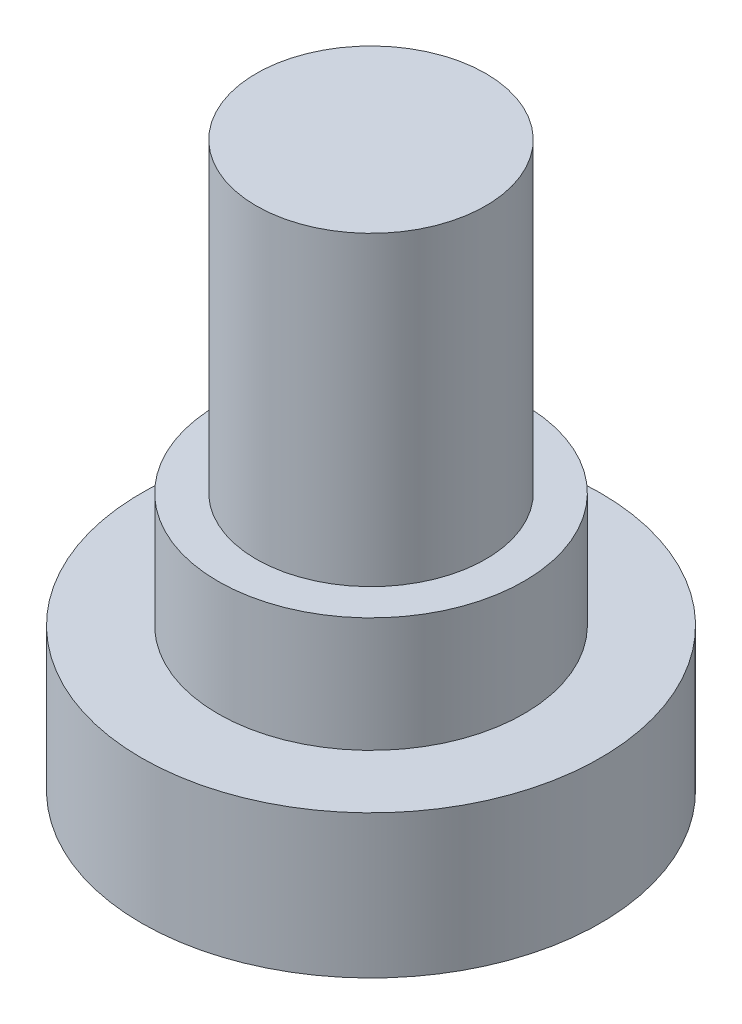
ISO-10303-21;
HEADER;
FILE_DESCRIPTION(('STEP AP214'),'2;1');
FILE_NAME('part.step','',(''),(''),'','','');
FILE_SCHEMA(('AUTOMOTIVE_DESIGN { 1 0 10303 214 1 1 1 1 }'));
ENDSEC;
DATA;
#1=APPLICATION_CONTEXT('core data for automotive mechanical design processes');
#2=APPLICATION_PROTOCOL_DEFINITION('international standard','automotive_design',2000,#1);
#3=PRODUCT_CONTEXT('',#1,'mechanical');
#4=PRODUCT('Part','Part','',(#3));
#5=PRODUCT_RELATED_PRODUCT_CATEGORY('part','',(#4));
#6=PRODUCT_DEFINITION_FORMATION('','',#4);
#7=PRODUCT_DEFINITION_CONTEXT('part definition',#1,'design');
#8=PRODUCT_DEFINITION('design','',#6,#7);
#9=PRODUCT_DEFINITION_SHAPE('','',#8);
#10=(LENGTH_UNIT() NAMED_UNIT(*) SI_UNIT(.MILLI.,.METRE.));
#11=(NAMED_UNIT(*) PLANE_ANGLE_UNIT() SI_UNIT($,.RADIAN.));
#12=(NAMED_UNIT(*) SI_UNIT($,.STERADIAN.) SOLID_ANGLE_UNIT());
#13=UNCERTAINTY_MEASURE_WITH_UNIT(LENGTH_MEASURE(1.E-05),#10,'distance_accuracy_value','');
#14=(GEOMETRIC_REPRESENTATION_CONTEXT(3) GLOBAL_UNCERTAINTY_ASSIGNED_CONTEXT((#13)) GLOBAL_UNIT_ASSIGNED_CONTEXT((#10,
#11,#12)) REPRESENTATION_CONTEXT('',''));
#15=CARTESIAN_POINT('',(0.,0.,0.));
#16=DIRECTION('',(0.,0.,1.));
#17=DIRECTION('',(1.,0.,0.));
#18=AXIS2_PLACEMENT_3D('',#15,#16,#17);
#19=CARTESIAN_POINT('',(0.,3.74,0.));
#20=DIRECTION('',(0.,-1.,0.));
#21=DIRECTION('',(0.,0.,-1.));
#22=AXIS2_PLACEMENT_3D('',#19,#20,#21);
#23=CYLINDRICAL_SURFACE('',#22,6.);
#24=CARTESIAN_POINT('',(0.,3.74,0.));
#25=DIRECTION('',(0.,1.,0.));
#26=DIRECTION('',(0.,0.,1.));
#27=AXIS2_PLACEMENT_3D('',#24,#25,#26);
#28=CIRCLE('',#27,6.);
#29=CARTESIAN_POINT('',(0.,3.74,6.));
#30=VERTEX_POINT('',#29);
#31=EDGE_CURVE('E51',#30,#30,#28,.T.);
#32=ORIENTED_EDGE('',*,*,#31,.F.);
#33=EDGE_LOOP('',(#32));
#34=FACE_BOUND('',#33,.T.);
#35=CARTESIAN_POINT('',(0.,0.,0.));
#36=DIRECTION('',(0.,1.,0.));
#37=DIRECTION('',(0.,0.,1.));
#38=AXIS2_PLACEMENT_3D('',#35,#36,#37);
#39=CIRCLE('',#38,6.);
#40=CARTESIAN_POINT('',(0.,0.,6.));
#41=VERTEX_POINT('',#40);
#42=EDGE_CURVE('E40',#41,#41,#39,.T.);
#43=ORIENTED_EDGE('',*,*,#42,.T.);
#44=EDGE_LOOP('',(#43));
#45=FACE_BOUND('',#44,.T.);
#46=ADVANCED_FACE('F37',(#34,#45),#23,.T.);
#47=CARTESIAN_POINT('',(0.,3.74,0.));
#48=DIRECTION('',(0.,1.,0.));
#49=DIRECTION('',(0.,0.,1.));
#50=AXIS2_PLACEMENT_3D('',#47,#48,#49);
#51=PLANE('',#50);
#52=CARTESIAN_POINT('',(0.,3.74,0.));
#53=DIRECTION('',(0.,1.,0.));
#54=DIRECTION('',(0.,0.,1.));
#55=AXIS2_PLACEMENT_3D('',#52,#53,#54);
#56=CIRCLE('',#55,4.);
#57=CARTESIAN_POINT('',(0.,3.74,4.));
#58=VERTEX_POINT('',#57);
#59=EDGE_CURVE('E45',#58,#58,#56,.T.);
#60=ORIENTED_EDGE('',*,*,#59,.F.);
#61=EDGE_LOOP('',(#60));
#62=FACE_BOUND('',#61,.T.);
#63=ORIENTED_EDGE('',*,*,#31,.T.);
#64=EDGE_LOOP('',(#63));
#65=FACE_BOUND('',#64,.T.);
#66=ADVANCED_FACE('F71',(#62,#65),#51,.T.);
#67=CARTESIAN_POINT('',(0.,0.,0.));
#68=DIRECTION('',(0.,1.,0.));
#69=DIRECTION('',(0.,0.,1.));
#70=AXIS2_PLACEMENT_3D('',#67,#68,#69);
#71=PLANE('',#70);
#72=ORIENTED_EDGE('',*,*,#42,.F.);
#73=EDGE_LOOP('',(#72));
#74=FACE_BOUND('',#73,.T.);
#75=ADVANCED_FACE('F68',(#74),#71,.F.);
#76=CARTESIAN_POINT('',(0.,6.74,0.));
#77=DIRECTION('',(0.,-1.,0.));
#78=DIRECTION('',(0.,0.,-1.));
#79=AXIS2_PLACEMENT_3D('',#76,#77,#78);
#80=CYLINDRICAL_SURFACE('',#79,4.);
#81=CARTESIAN_POINT('',(0.,6.74,0.));
#82=DIRECTION('',(0.,1.,0.));
#83=DIRECTION('',(0.,0.,1.));
#84=AXIS2_PLACEMENT_3D('',#81,#82,#83);
#85=CIRCLE('',#84,4.);
#86=CARTESIAN_POINT('',(0.,6.74,4.));
#87=VERTEX_POINT('',#86);
#88=EDGE_CURVE('E56',#87,#87,#85,.T.);
#89=ORIENTED_EDGE('',*,*,#88,.F.);
#90=EDGE_LOOP('',(#89));
#91=FACE_BOUND('',#90,.T.);
#92=ORIENTED_EDGE('',*,*,#59,.T.);
#93=EDGE_LOOP('',(#92));
#94=FACE_BOUND('',#93,.T.);
#95=ADVANCED_FACE('F70',(#91,#94),#80,.T.);
#96=CARTESIAN_POINT('',(0.,6.74,0.));
#97=DIRECTION('',(0.,1.,0.));
#98=DIRECTION('',(0.,0.,1.));
#99=AXIS2_PLACEMENT_3D('',#96,#97,#98);
#100=PLANE('',#99);
#101=CARTESIAN_POINT('',(0.,6.74,0.));
#102=DIRECTION('',(0.,1.,0.));
#103=DIRECTION('',(0.,0.,1.));
#104=AXIS2_PLACEMENT_3D('',#101,#102,#103);
#105=CIRCLE('',#104,3.);
#106=CARTESIAN_POINT('',(0.,6.74,3.));
#107=VERTEX_POINT('',#106);
#108=EDGE_CURVE('E10',#107,#107,#105,.T.);
#109=ORIENTED_EDGE('',*,*,#108,.F.);
#110=EDGE_LOOP('',(#109));
#111=FACE_BOUND('',#110,.T.);
#112=ORIENTED_EDGE('',*,*,#88,.T.);
#113=EDGE_LOOP('',(#112));
#114=FACE_BOUND('',#113,.T.);
#115=ADVANCED_FACE('F76',(#111,#114),#100,.T.);
#116=CARTESIAN_POINT('',(0.,14.74,0.));
#117=DIRECTION('',(0.,-1.,0.));
#118=DIRECTION('',(0.,0.,-1.));
#119=AXIS2_PLACEMENT_3D('',#116,#117,#118);
#120=CYLINDRICAL_SURFACE('',#119,3.);
#121=CARTESIAN_POINT('',(0.,14.74,0.));
#122=DIRECTION('',(0.,1.,0.));
#123=DIRECTION('',(0.,0.,1.));
#124=AXIS2_PLACEMENT_3D('',#121,#122,#123);
#125=CIRCLE('',#124,3.);
#126=CARTESIAN_POINT('',(0.,14.74,3.));
#127=VERTEX_POINT('',#126);
#128=EDGE_CURVE('E55',#127,#127,#125,.T.);
#129=ORIENTED_EDGE('',*,*,#128,.F.);
#130=EDGE_LOOP('',(#129));
#131=FACE_BOUND('',#130,.T.);
#132=ORIENTED_EDGE('',*,*,#108,.T.);
#133=EDGE_LOOP('',(#132));
#134=FACE_BOUND('',#133,.T.);
#135=ADVANCED_FACE('F106',(#131,#134),#120,.T.);
#136=CARTESIAN_POINT('',(0.,14.74,0.));
#137=DIRECTION('',(0.,1.,0.));
#138=DIRECTION('',(0.,0.,1.));
#139=AXIS2_PLACEMENT_3D('',#136,#137,#138);
#140=PLANE('',#139);
#141=ORIENTED_EDGE('',*,*,#128,.T.);
#142=EDGE_LOOP('',(#141));
#143=FACE_BOUND('',#142,.T.);
#144=ADVANCED_FACE('F116',(#143),#140,.T.);
#145=CLOSED_SHELL('',(#46,#66,#75,#95,#115,#135,#144));
#146=MANIFOLD_SOLID_BREP('B2',#145);
#147=ADVANCED_BREP_SHAPE_REPRESENTATION('',(#18,#146),#14);
#148=SHAPE_DEFINITION_REPRESENTATION(#9,#147);
ENDSEC;
END-ISO-10303-21;
